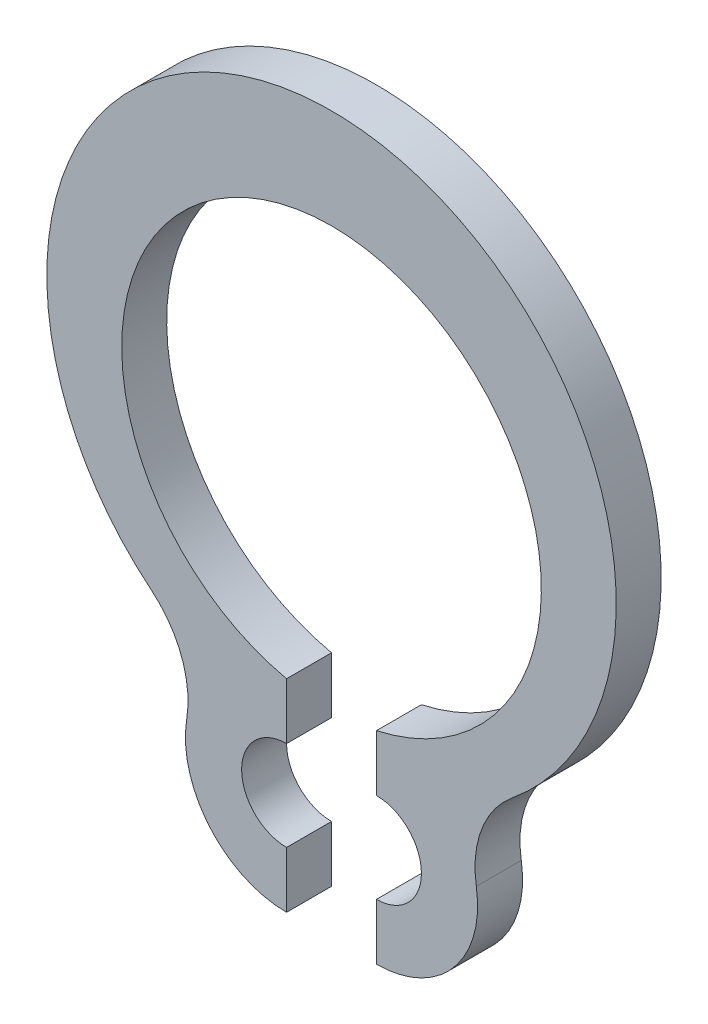
ISO-10303-21;
HEADER;
FILE_DESCRIPTION(('STEP AP214'),'2;1');
FILE_NAME('part.step','',(''),(''),'','','');
FILE_SCHEMA(('AUTOMOTIVE_DESIGN { 1 0 10303 214 1 1 1 1 }'));
ENDSEC;
DATA;
#1=APPLICATION_CONTEXT('core data for automotive mechanical design processes');
#2=APPLICATION_PROTOCOL_DEFINITION('international standard','automotive_design',2000,#1);
#3=PRODUCT_CONTEXT('',#1,'mechanical');
#4=PRODUCT('Part','Part','',(#3));
#5=PRODUCT_RELATED_PRODUCT_CATEGORY('part','',(#4));
#6=PRODUCT_DEFINITION_FORMATION('','',#4);
#7=PRODUCT_DEFINITION_CONTEXT('part definition',#1,'design');
#8=PRODUCT_DEFINITION('design','',#6,#7);
#9=PRODUCT_DEFINITION_SHAPE('','',#8);
#10=(LENGTH_UNIT() NAMED_UNIT(*) SI_UNIT(.MILLI.,.METRE.));
#11=(NAMED_UNIT(*) PLANE_ANGLE_UNIT() SI_UNIT($,.RADIAN.));
#12=(NAMED_UNIT(*) SI_UNIT($,.STERADIAN.) SOLID_ANGLE_UNIT());
#13=UNCERTAINTY_MEASURE_WITH_UNIT(LENGTH_MEASURE(1.E-05),#10,'distance_accuracy_value','');
#14=(GEOMETRIC_REPRESENTATION_CONTEXT(3) GLOBAL_UNCERTAINTY_ASSIGNED_CONTEXT((#13)) GLOBAL_UNIT_ASSIGNED_CONTEXT((#10,
#11,#12)) REPRESENTATION_CONTEXT('',''));
#15=CARTESIAN_POINT('',(0.,0.,0.));
#16=DIRECTION('',(0.,0.,1.));
#17=DIRECTION('',(1.,0.,0.));
#18=AXIS2_PLACEMENT_3D('',#15,#16,#17);
#19=CARTESIAN_POINT('',(-0.6,-4.41495886623547,-0.6));
#20=DIRECTION('',(0.,0.,1.));
#21=DIRECTION('',(1.,0.,0.));
#22=AXIS2_PLACEMENT_3D('',#19,#20,#21);
#23=PLANE('',#22);
#24=DIRECTION('',(0.,1.,0.));
#25=VECTOR('',#24,1.);
#26=CARTESIAN_POINT('',(-0.6,-4.41495886623547,-0.6));
#27=LINE('',#26,#25);
#28=CARTESIAN_POINT('',(-0.599999999999999,-5.76495886623547,-0.6));
#29=VERTEX_POINT('',#28);
#30=CARTESIAN_POINT('',(-0.6,-5.01495886623547,-0.6));
#31=VERTEX_POINT('',#30);
#32=EDGE_CURVE('E111',#29,#31,#27,.T.);
#33=ORIENTED_EDGE('',*,*,#32,.F.);
#34=CARTESIAN_POINT('',(-0.6,-4.41495886623547,-0.6));
#35=DIRECTION('',(0.,0.,1.));
#36=DIRECTION('',(1.,0.,0.));
#37=AXIS2_PLACEMENT_3D('',#34,#35,#36);
#38=CIRCLE('',#37,1.35);
#39=CARTESIAN_POINT('',(-1.93258015045455,-4.19878730794317,-0.6));
#40=VERTEX_POINT('',#39);
#41=EDGE_CURVE('E168',#40,#29,#38,.T.);
#42=ORIENTED_EDGE('',*,*,#41,.F.);
#43=CARTESIAN_POINT('',(-3.26516030090911,-3.98261574965087,-0.6));
#44=DIRECTION('',(0.,0.,1.));
#45=DIRECTION('',(1.,0.,0.));
#46=AXIS2_PLACEMENT_3D('',#43,#44,#45);
#47=CIRCLE('',#46,1.35);
#48=CARTESIAN_POINT('',(-2.40924449387468,-2.93862909682977,-0.6));
#49=VERTEX_POINT('',#48);
#50=EDGE_CURVE('E172',#40,#49,#47,.T.);
#51=ORIENTED_EDGE('',*,*,#50,.T.);
#52=CARTESIAN_POINT('',(0.,0.,-0.6));
#53=DIRECTION('',(0.,0.,1.));
#54=DIRECTION('',(1.,0.,0.));
#55=AXIS2_PLACEMENT_3D('',#52,#53,#54);
#56=CIRCLE('',#55,3.8);
#57=CARTESIAN_POINT('',(2.40924449387468,-2.93862909682977,-0.6));
#58=VERTEX_POINT('',#57);
#59=EDGE_CURVE('E176',#58,#49,#56,.T.);
#60=ORIENTED_EDGE('',*,*,#59,.F.);
#61=CARTESIAN_POINT('',(3.26516030090911,-3.98261574965087,-0.6));
#62=DIRECTION('',(0.,0.,1.));
#63=DIRECTION('',(1.,0.,0.));
#64=AXIS2_PLACEMENT_3D('',#61,#62,#63);
#65=CIRCLE('',#64,1.35);
#66=CARTESIAN_POINT('',(1.93258015045455,-4.19878730794317,-0.6));
#67=VERTEX_POINT('',#66);
#68=EDGE_CURVE('E181',#58,#67,#65,.T.);
#69=ORIENTED_EDGE('',*,*,#68,.T.);
#70=CARTESIAN_POINT('',(0.600000000000001,-4.41495886623547,-0.6));
#71=DIRECTION('',(0.,0.,1.));
#72=DIRECTION('',(1.,0.,0.));
#73=AXIS2_PLACEMENT_3D('',#70,#71,#72);
#74=CIRCLE('',#73,1.35);
#75=CARTESIAN_POINT('',(0.600000000000001,-5.76495886623547,-0.6));
#76=VERTEX_POINT('',#75);
#77=EDGE_CURVE('E185',#76,#67,#74,.T.);
#78=ORIENTED_EDGE('',*,*,#77,.F.);
#79=DIRECTION('',(0.,-1.,0.));
#80=VECTOR('',#79,1.);
#81=CARTESIAN_POINT('',(0.600000000000001,-5.01495886623547,-0.6));
#82=LINE('',#81,#80);
#83=CARTESIAN_POINT('',(0.600000000000001,-5.01495886623547,-0.6));
#84=VERTEX_POINT('',#83);
#85=EDGE_CURVE('E131',#84,#76,#82,.T.);
#86=ORIENTED_EDGE('',*,*,#85,.F.);
#87=CARTESIAN_POINT('',(0.600000000000001,-4.41495886623547,-0.6));
#88=DIRECTION('',(0.,0.,1.));
#89=DIRECTION('',(1.,0.,0.));
#90=AXIS2_PLACEMENT_3D('',#87,#88,#89);
#91=CIRCLE('',#90,0.6);
#92=CARTESIAN_POINT('',(0.600000000000001,-3.81495886623547,-0.6));
#93=VERTEX_POINT('',#92);
#94=EDGE_CURVE('E189',#84,#93,#91,.T.);
#95=ORIENTED_EDGE('',*,*,#94,.T.);
#96=DIRECTION('',(0.,-1.,0.));
#97=VECTOR('',#96,1.);
#98=CARTESIAN_POINT('',(0.6,-3.06495886623547,-0.6));
#99=LINE('',#98,#97);
#100=CARTESIAN_POINT('',(0.6,-3.06495886623547,-0.6));
#101=VERTEX_POINT('',#100);
#102=EDGE_CURVE('E137',#101,#93,#99,.T.);
#103=ORIENTED_EDGE('',*,*,#102,.F.);
#104=CARTESIAN_POINT('',(0.,-0.33,-0.6));
#105=DIRECTION('',(0.,0.,1.));
#106=DIRECTION('',(1.,0.,0.));
#107=AXIS2_PLACEMENT_3D('',#104,#105,#106);
#108=CIRCLE('',#107,2.8);
#109=CARTESIAN_POINT('',(-0.6,-3.06495886623547,-0.6));
#110=VERTEX_POINT('',#109);
#111=EDGE_CURVE('E115',#101,#110,#108,.T.);
#112=ORIENTED_EDGE('',*,*,#111,.T.);
#113=DIRECTION('',(0.,1.,0.));
#114=VECTOR('',#113,1.);
#115=CARTESIAN_POINT('',(-0.6,-3.06495886623547,-0.6));
#116=LINE('',#115,#114);
#117=CARTESIAN_POINT('',(-0.6,-3.81495886623547,-0.6));
#118=VERTEX_POINT('',#117);
#119=EDGE_CURVE('E113',#118,#110,#116,.T.);
#120=ORIENTED_EDGE('',*,*,#119,.F.);
#121=CARTESIAN_POINT('',(-0.6,-4.41495886623547,-0.6));
#122=DIRECTION('',(0.,0.,1.));
#123=DIRECTION('',(1.,0.,0.));
#124=AXIS2_PLACEMENT_3D('',#121,#122,#123);
#125=CIRCLE('',#124,0.6);
#126=EDGE_CURVE('E19',#118,#31,#125,.T.);
#127=ORIENTED_EDGE('',*,*,#126,.T.);
#128=EDGE_LOOP('',(#33,#42,#51,#60,#69,#78,#86,#95,#103,#112,#120,#127));
#129=FACE_BOUND('',#128,.T.);
#130=ADVANCED_FACE('F16',(#129),#23,.F.);
#131=CARTESIAN_POINT('',(-0.6,-4.41495886623547,-0.6));
#132=DIRECTION('',(0.,0.,1.));
#133=DIRECTION('',(1.,0.,0.));
#134=AXIS2_PLACEMENT_3D('',#131,#132,#133);
#135=CYLINDRICAL_SURFACE('',#134,0.6);
#136=DIRECTION('',(0.,0.,1.));
#137=VECTOR('',#136,1.);
#138=CARTESIAN_POINT('',(-0.6,-5.01495886623547,-0.6));
#139=LINE('',#138,#137);
#140=CARTESIAN_POINT('',(-0.6,-5.01495886623547,0.));
#141=VERTEX_POINT('',#140);
#142=EDGE_CURVE('E109',#31,#141,#139,.T.);
#143=ORIENTED_EDGE('',*,*,#142,.F.);
#144=ORIENTED_EDGE('',*,*,#126,.F.);
#145=DIRECTION('',(0.,0.,1.));
#146=VECTOR('',#145,1.);
#147=CARTESIAN_POINT('',(-0.6,-3.81495886623547,-0.6));
#148=LINE('',#147,#146);
#149=CARTESIAN_POINT('',(-0.6,-3.81495886623547,0.));
#150=VERTEX_POINT('',#149);
#151=EDGE_CURVE('E106',#150,#118,#148,.F.);
#152=ORIENTED_EDGE('',*,*,#151,.F.);
#153=CARTESIAN_POINT('',(-0.6,-4.41495886623547,0.));
#154=DIRECTION('',(0.,0.,1.));
#155=DIRECTION('',(1.,0.,0.));
#156=AXIS2_PLACEMENT_3D('',#153,#154,#155);
#157=CIRCLE('',#156,0.6);
#158=EDGE_CURVE('E165',#141,#150,#157,.F.);
#159=ORIENTED_EDGE('',*,*,#158,.F.);
#160=EDGE_LOOP('',(#143,#144,#152,#159));
#161=FACE_BOUND('',#160,.T.);
#162=ADVANCED_FACE('F104',(#161),#135,.F.);
#163=CARTESIAN_POINT('',(-0.6,-3.06495886623547,-0.6));
#164=DIRECTION('',(1.,0.,0.));
#165=DIRECTION('',(0.,1.,0.));
#166=AXIS2_PLACEMENT_3D('',#163,#164,#165);
#167=PLANE('',#166);
#168=ORIENTED_EDGE('',*,*,#119,.T.);
#169=DIRECTION('',(0.,0.,1.));
#170=VECTOR('',#169,1.);
#171=CARTESIAN_POINT('',(-0.600000000000001,-3.06495886623547,-0.6));
#172=LINE('',#171,#170);
#173=CARTESIAN_POINT('',(-0.6,-3.06495886623547,0.));
#174=VERTEX_POINT('',#173);
#175=EDGE_CURVE('E119',#110,#174,#172,.T.);
#176=ORIENTED_EDGE('',*,*,#175,.T.);
#177=DIRECTION('',(0.,1.,0.));
#178=VECTOR('',#177,1.);
#179=CARTESIAN_POINT('',(-0.6,-4.41495886623547,0.));
#180=LINE('',#179,#178);
#181=EDGE_CURVE('E123',#150,#174,#180,.T.);
#182=ORIENTED_EDGE('',*,*,#181,.F.);
#183=ORIENTED_EDGE('',*,*,#151,.T.);
#184=EDGE_LOOP('',(#168,#176,#182,#183));
#185=FACE_BOUND('',#184,.T.);
#186=ADVANCED_FACE('F121',(#185),#167,.T.);
#187=CARTESIAN_POINT('',(0.,-0.33,-0.6));
#188=DIRECTION('',(0.,0.,1.));
#189=DIRECTION('',(1.,0.,0.));
#190=AXIS2_PLACEMENT_3D('',#187,#188,#189);
#191=CYLINDRICAL_SURFACE('',#190,2.8);
#192=ORIENTED_EDGE('',*,*,#111,.F.);
#193=DIRECTION('',(0.,0.,1.));
#194=VECTOR('',#193,1.);
#195=CARTESIAN_POINT('',(0.6,-3.06495886623547,-0.6));
#196=LINE('',#195,#194);
#197=CARTESIAN_POINT('',(0.6,-3.06495886623547,0.));
#198=VERTEX_POINT('',#197);
#199=EDGE_CURVE('E140',#198,#101,#196,.F.);
#200=ORIENTED_EDGE('',*,*,#199,.F.);
#201=CARTESIAN_POINT('',(0.,-0.33,0.));
#202=DIRECTION('',(0.,0.,1.));
#203=DIRECTION('',(1.,0.,0.));
#204=AXIS2_PLACEMENT_3D('',#201,#202,#203);
#205=CIRCLE('',#204,2.8);
#206=EDGE_CURVE('E162',#174,#198,#205,.F.);
#207=ORIENTED_EDGE('',*,*,#206,.F.);
#208=ORIENTED_EDGE('',*,*,#175,.F.);
#209=EDGE_LOOP('',(#192,#200,#207,#208));
#210=FACE_BOUND('',#209,.T.);
#211=ADVANCED_FACE('F198',(#210),#191,.F.);
#212=CARTESIAN_POINT('',(0.6,-3.06495886623547,-0.6));
#213=DIRECTION('',(-1.,0.,0.));
#214=DIRECTION('',(0.,-1.,0.));
#215=AXIS2_PLACEMENT_3D('',#212,#213,#214);
#216=PLANE('',#215);
#217=ORIENTED_EDGE('',*,*,#102,.T.);
#218=DIRECTION('',(0.,0.,1.));
#219=VECTOR('',#218,1.);
#220=CARTESIAN_POINT('',(0.600000000000001,-3.81495886623547,-0.6));
#221=LINE('',#220,#219);
#222=CARTESIAN_POINT('',(0.6,-3.81495886623547,0.));
#223=VERTEX_POINT('',#222);
#224=EDGE_CURVE('E139',#93,#223,#221,.T.);
#225=ORIENTED_EDGE('',*,*,#224,.T.);
#226=DIRECTION('',(0.,1.,0.));
#227=VECTOR('',#226,1.);
#228=CARTESIAN_POINT('',(0.6,-4.41495886623547,0.));
#229=LINE('',#228,#227);
#230=EDGE_CURVE('E161',#198,#223,#229,.F.);
#231=ORIENTED_EDGE('',*,*,#230,.F.);
#232=ORIENTED_EDGE('',*,*,#199,.T.);
#233=EDGE_LOOP('',(#217,#225,#231,#232));
#234=FACE_BOUND('',#233,.T.);
#235=ADVANCED_FACE('F226',(#234),#216,.T.);
#236=CARTESIAN_POINT('',(0.600000000000001,-4.41495886623547,-0.6));
#237=DIRECTION('',(0.,0.,1.));
#238=DIRECTION('',(1.,0.,0.));
#239=AXIS2_PLACEMENT_3D('',#236,#237,#238);
#240=CYLINDRICAL_SURFACE('',#239,0.6);
#241=ORIENTED_EDGE('',*,*,#94,.F.);
#242=DIRECTION('',(0.,0.,1.));
#243=VECTOR('',#242,1.);
#244=CARTESIAN_POINT('',(0.600000000000001,-5.01495886623547,-0.6));
#245=LINE('',#244,#243);
#246=CARTESIAN_POINT('',(0.600000000000001,-5.01495886623547,0.));
#247=VERTEX_POINT('',#246);
#248=EDGE_CURVE('E136',#247,#84,#245,.F.);
#249=ORIENTED_EDGE('',*,*,#248,.F.);
#250=CARTESIAN_POINT('',(0.600000000000001,-4.41495886623547,0.));
#251=DIRECTION('',(0.,0.,1.));
#252=DIRECTION('',(1.,0.,0.));
#253=AXIS2_PLACEMENT_3D('',#250,#251,#252);
#254=CIRCLE('',#253,0.6);
#255=EDGE_CURVE('E159',#223,#247,#254,.F.);
#256=ORIENTED_EDGE('',*,*,#255,.F.);
#257=ORIENTED_EDGE('',*,*,#224,.F.);
#258=EDGE_LOOP('',(#241,#249,#256,#257));
#259=FACE_BOUND('',#258,.T.);
#260=ADVANCED_FACE('F229',(#259),#240,.F.);
#261=CARTESIAN_POINT('',(0.600000000000001,-5.01495886623547,-0.6));
#262=DIRECTION('',(-1.,0.,0.));
#263=DIRECTION('',(0.,-1.,0.));
#264=AXIS2_PLACEMENT_3D('',#261,#262,#263);
#265=PLANE('',#264);
#266=ORIENTED_EDGE('',*,*,#85,.T.);
#267=DIRECTION('',(0.,0.,1.));
#268=VECTOR('',#267,1.);
#269=CARTESIAN_POINT('',(0.600000000000001,-5.76495886623547,-0.6));
#270=LINE('',#269,#268);
#271=CARTESIAN_POINT('',(0.600000000000001,-5.76495886623547,0.));
#272=VERTEX_POINT('',#271);
#273=EDGE_CURVE('E135',#272,#76,#270,.F.);
#274=ORIENTED_EDGE('',*,*,#273,.F.);
#275=DIRECTION('',(0.,1.,0.));
#276=VECTOR('',#275,1.);
#277=CARTESIAN_POINT('',(0.600000000000001,-4.41495886623547,0.));
#278=LINE('',#277,#276);
#279=EDGE_CURVE('E158',#247,#272,#278,.F.);
#280=ORIENTED_EDGE('',*,*,#279,.F.);
#281=ORIENTED_EDGE('',*,*,#248,.T.);
#282=EDGE_LOOP('',(#266,#274,#280,#281));
#283=FACE_BOUND('',#282,.T.);
#284=ADVANCED_FACE('F234',(#283),#265,.T.);
#285=CARTESIAN_POINT('',(0.600000000000001,-4.41495886623547,-0.6));
#286=DIRECTION('',(0.,0.,1.));
#287=DIRECTION('',(1.,0.,0.));
#288=AXIS2_PLACEMENT_3D('',#285,#286,#287);
#289=CYLINDRICAL_SURFACE('',#288,1.35);
#290=DIRECTION('',(0.,0.,1.));
#291=VECTOR('',#290,1.);
#292=CARTESIAN_POINT('',(1.93258015045455,-4.19878730794317,-0.6));
#293=LINE('',#292,#291);
#294=CARTESIAN_POINT('',(1.93258015045455,-4.19878730794317,0.));
#295=VERTEX_POINT('',#294);
#296=EDGE_CURVE('E184',#67,#295,#293,.T.);
#297=ORIENTED_EDGE('',*,*,#296,.T.);
#298=CARTESIAN_POINT('',(0.600000000000001,-4.41495886623547,0.));
#299=DIRECTION('',(0.,0.,1.));
#300=DIRECTION('',(1.,0.,0.));
#301=AXIS2_PLACEMENT_3D('',#298,#299,#300);
#302=CIRCLE('',#301,1.35);
#303=EDGE_CURVE('E155',#272,#295,#302,.T.);
#304=ORIENTED_EDGE('',*,*,#303,.F.);
#305=ORIENTED_EDGE('',*,*,#273,.T.);
#306=ORIENTED_EDGE('',*,*,#77,.T.);
#307=EDGE_LOOP('',(#297,#304,#305,#306));
#308=FACE_BOUND('',#307,.T.);
#309=ADVANCED_FACE('F237',(#308),#289,.T.);
#310=CARTESIAN_POINT('',(3.26516030090911,-3.98261574965087,-0.6));
#311=DIRECTION('',(0.,0.,1.));
#312=DIRECTION('',(1.,0.,0.));
#313=AXIS2_PLACEMENT_3D('',#310,#311,#312);
#314=CYLINDRICAL_SURFACE('',#313,1.35);
#315=ORIENTED_EDGE('',*,*,#296,.F.);
#316=ORIENTED_EDGE('',*,*,#68,.F.);
#317=DIRECTION('',(0.,0.,1.));
#318=VECTOR('',#317,1.);
#319=CARTESIAN_POINT('',(2.40924449387468,-2.93862909682977,-0.6));
#320=LINE('',#319,#318);
#321=CARTESIAN_POINT('',(2.40924449387468,-2.93862909682977,0.));
#322=VERTEX_POINT('',#321);
#323=EDGE_CURVE('E180',#322,#58,#320,.F.);
#324=ORIENTED_EDGE('',*,*,#323,.F.);
#325=CARTESIAN_POINT('',(3.26516030090911,-3.98261574965087,0.));
#326=DIRECTION('',(0.,0.,1.));
#327=DIRECTION('',(1.,0.,0.));
#328=AXIS2_PLACEMENT_3D('',#325,#326,#327);
#329=CIRCLE('',#328,1.35);
#330=EDGE_CURVE('E151',#295,#322,#329,.F.);
#331=ORIENTED_EDGE('',*,*,#330,.F.);
#332=EDGE_LOOP('',(#315,#316,#324,#331));
#333=FACE_BOUND('',#332,.T.);
#334=ADVANCED_FACE('F242',(#333),#314,.F.);
#335=CARTESIAN_POINT('',(0.,0.,-0.6));
#336=DIRECTION('',(0.,0.,1.));
#337=DIRECTION('',(1.,0.,0.));
#338=AXIS2_PLACEMENT_3D('',#335,#336,#337);
#339=CYLINDRICAL_SURFACE('',#338,3.8);
#340=DIRECTION('',(0.,0.,1.));
#341=VECTOR('',#340,1.);
#342=CARTESIAN_POINT('',(-2.40924449387468,-2.93862909682977,-0.6));
#343=LINE('',#342,#341);
#344=CARTESIAN_POINT('',(-2.40924449387468,-2.93862909682977,0.));
#345=VERTEX_POINT('',#344);
#346=EDGE_CURVE('E175',#49,#345,#343,.T.);
#347=ORIENTED_EDGE('',*,*,#346,.T.);
#348=CARTESIAN_POINT('',(0.,0.,0.));
#349=DIRECTION('',(0.,0.,1.));
#350=DIRECTION('',(1.,0.,0.));
#351=AXIS2_PLACEMENT_3D('',#348,#349,#350);
#352=CIRCLE('',#351,3.8);
#353=EDGE_CURVE('E148',#322,#345,#352,.T.);
#354=ORIENTED_EDGE('',*,*,#353,.F.);
#355=ORIENTED_EDGE('',*,*,#323,.T.);
#356=ORIENTED_EDGE('',*,*,#59,.T.);
#357=EDGE_LOOP('',(#347,#354,#355,#356));
#358=FACE_BOUND('',#357,.T.);
#359=ADVANCED_FACE('F248',(#358),#339,.T.);
#360=CARTESIAN_POINT('',(-3.26516030090911,-3.98261574965087,-0.6));
#361=DIRECTION('',(0.,0.,1.));
#362=DIRECTION('',(1.,0.,0.));
#363=AXIS2_PLACEMENT_3D('',#360,#361,#362);
#364=CYLINDRICAL_SURFACE('',#363,1.35);
#365=ORIENTED_EDGE('',*,*,#50,.F.);
#366=DIRECTION('',(0.,0.,1.));
#367=VECTOR('',#366,1.);
#368=CARTESIAN_POINT('',(-1.93258015045455,-4.19878730794317,-0.6));
#369=LINE('',#368,#367);
#370=CARTESIAN_POINT('',(-1.93258015045455,-4.19878730794317,0.));
#371=VERTEX_POINT('',#370);
#372=EDGE_CURVE('E171',#371,#40,#369,.F.);
#373=ORIENTED_EDGE('',*,*,#372,.F.);
#374=CARTESIAN_POINT('',(-3.26516030090911,-3.98261574965087,0.));
#375=DIRECTION('',(0.,0.,1.));
#376=DIRECTION('',(1.,0.,0.));
#377=AXIS2_PLACEMENT_3D('',#374,#375,#376);
#378=CIRCLE('',#377,1.35);
#379=EDGE_CURVE('E145',#345,#371,#378,.F.);
#380=ORIENTED_EDGE('',*,*,#379,.F.);
#381=ORIENTED_EDGE('',*,*,#346,.F.);
#382=EDGE_LOOP('',(#365,#373,#380,#381));
#383=FACE_BOUND('',#382,.T.);
#384=ADVANCED_FACE('F250',(#383),#364,.F.);
#385=CARTESIAN_POINT('',(-0.6,-4.41495886623547,-0.6));
#386=DIRECTION('',(0.,0.,1.));
#387=DIRECTION('',(1.,0.,0.));
#388=AXIS2_PLACEMENT_3D('',#385,#386,#387);
#389=CYLINDRICAL_SURFACE('',#388,1.35);
#390=ORIENTED_EDGE('',*,*,#41,.T.);
#391=DIRECTION('',(0.,0.,1.));
#392=VECTOR('',#391,1.);
#393=CARTESIAN_POINT('',(-0.599999999999999,-5.76495886623547,-0.6));
#394=LINE('',#393,#392);
#395=CARTESIAN_POINT('',(-0.599999999999999,-5.76495886623547,0.));
#396=VERTEX_POINT('',#395);
#397=EDGE_CURVE('E34',#396,#29,#394,.F.);
#398=ORIENTED_EDGE('',*,*,#397,.F.);
#399=CARTESIAN_POINT('',(-0.6,-4.41495886623547,0.));
#400=DIRECTION('',(0.,0.,1.));
#401=DIRECTION('',(1.,0.,0.));
#402=AXIS2_PLACEMENT_3D('',#399,#400,#401);
#403=CIRCLE('',#402,1.35);
#404=EDGE_CURVE('E25',#371,#396,#403,.T.);
#405=ORIENTED_EDGE('',*,*,#404,.F.);
#406=ORIENTED_EDGE('',*,*,#372,.T.);
#407=EDGE_LOOP('',(#390,#398,#405,#406));
#408=FACE_BOUND('',#407,.T.);
#409=ADVANCED_FACE('F252',(#408),#389,.T.);
#410=CARTESIAN_POINT('',(-0.6,-5.01495886623547,-0.6));
#411=DIRECTION('',(1.,0.,0.));
#412=DIRECTION('',(0.,1.,0.));
#413=AXIS2_PLACEMENT_3D('',#410,#411,#412);
#414=PLANE('',#413);
#415=ORIENTED_EDGE('',*,*,#32,.T.);
#416=ORIENTED_EDGE('',*,*,#142,.T.);
#417=DIRECTION('',(0.,1.,0.));
#418=VECTOR('',#417,1.);
#419=CARTESIAN_POINT('',(-0.6,-4.41495886623547,0.));
#420=LINE('',#419,#418);
#421=EDGE_CURVE('E11',#396,#141,#420,.T.);
#422=ORIENTED_EDGE('',*,*,#421,.F.);
#423=ORIENTED_EDGE('',*,*,#397,.T.);
#424=EDGE_LOOP('',(#415,#416,#422,#423));
#425=FACE_BOUND('',#424,.T.);
#426=ADVANCED_FACE('F254',(#425),#414,.T.);
#427=CARTESIAN_POINT('',(-0.6,-4.41495886623547,0.));
#428=DIRECTION('',(0.,0.,1.));
#429=DIRECTION('',(1.,0.,0.));
#430=AXIS2_PLACEMENT_3D('',#427,#428,#429);
#431=PLANE('',#430);
#432=ORIENTED_EDGE('',*,*,#404,.T.);
#433=ORIENTED_EDGE('',*,*,#421,.T.);
#434=ORIENTED_EDGE('',*,*,#158,.T.);
#435=ORIENTED_EDGE('',*,*,#181,.T.);
#436=ORIENTED_EDGE('',*,*,#206,.T.);
#437=ORIENTED_EDGE('',*,*,#230,.T.);
#438=ORIENTED_EDGE('',*,*,#255,.T.);
#439=ORIENTED_EDGE('',*,*,#279,.T.);
#440=ORIENTED_EDGE('',*,*,#303,.T.);
#441=ORIENTED_EDGE('',*,*,#330,.T.);
#442=ORIENTED_EDGE('',*,*,#353,.T.);
#443=ORIENTED_EDGE('',*,*,#379,.T.);
#444=EDGE_LOOP('',(#432,#433,#434,#435,#436,#437,#438,#439,#440,#441,#442,#443));
#445=FACE_BOUND('',#444,.T.);
#446=ADVANCED_FACE('F202',(#445),#431,.T.);
#447=CLOSED_SHELL('',(#130,#162,#186,#211,#235,#260,#284,#309,#334,#359,#384,#409,#426,#446));
#448=MANIFOLD_SOLID_BREP('B1',#447);
#449=ADVANCED_BREP_SHAPE_REPRESENTATION('',(#18,#448),#14);
#450=SHAPE_DEFINITION_REPRESENTATION(#9,#449);
ENDSEC;
END-ISO-10303-21;
